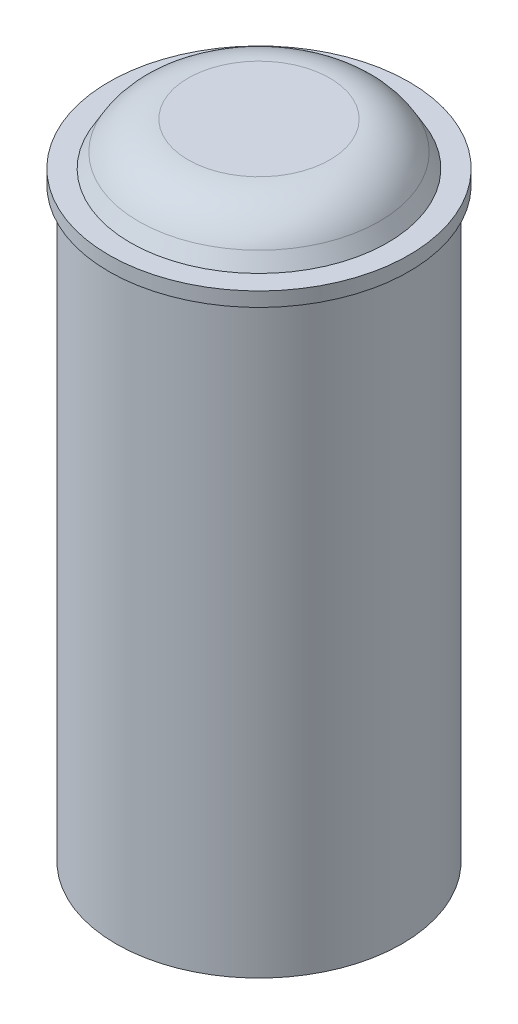
ISO-10303-21;
HEADER;
FILE_DESCRIPTION(('STEP AP214'),'2;1');
FILE_NAME('part.step','',(''),(''),'','','');
FILE_SCHEMA(('AUTOMOTIVE_DESIGN { 1 0 10303 214 1 1 1 1 }'));
ENDSEC;
DATA;
#1=APPLICATION_CONTEXT('core data for automotive mechanical design processes');
#2=APPLICATION_PROTOCOL_DEFINITION('international standard','automotive_design',2000,#1);
#3=PRODUCT_CONTEXT('',#1,'mechanical');
#4=PRODUCT('Part','Part','',(#3));
#5=PRODUCT_RELATED_PRODUCT_CATEGORY('part','',(#4));
#6=PRODUCT_DEFINITION_FORMATION('','',#4);
#7=PRODUCT_DEFINITION_CONTEXT('part definition',#1,'design');
#8=PRODUCT_DEFINITION('design','',#6,#7);
#9=PRODUCT_DEFINITION_SHAPE('','',#8);
#10=(LENGTH_UNIT() NAMED_UNIT(*) SI_UNIT(.MILLI.,.METRE.));
#11=(NAMED_UNIT(*) PLANE_ANGLE_UNIT() SI_UNIT($,.RADIAN.));
#12=(NAMED_UNIT(*) SI_UNIT($,.STERADIAN.) SOLID_ANGLE_UNIT());
#13=UNCERTAINTY_MEASURE_WITH_UNIT(LENGTH_MEASURE(1.E-05),#10,'distance_accuracy_value','');
#14=(GEOMETRIC_REPRESENTATION_CONTEXT(3) GLOBAL_UNCERTAINTY_ASSIGNED_CONTEXT((#13)) GLOBAL_UNIT_ASSIGNED_CONTEXT((#10,
#11,#12)) REPRESENTATION_CONTEXT('',''));
#15=CARTESIAN_POINT('',(0.,0.,0.));
#16=DIRECTION('',(0.,0.,1.));
#17=DIRECTION('',(1.,0.,0.));
#18=AXIS2_PLACEMENT_3D('',#15,#16,#17);
#19=CARTESIAN_POINT('',(0.,53.34,0.));
#20=DIRECTION('',(0.,1.,0.));
#21=DIRECTION('',(0.,0.,1.));
#22=AXIS2_PLACEMENT_3D('',#19,#20,#21);
#23=PLANE('',#22);
#24=CARTESIAN_POINT('',(0.,53.34,0.));
#25=DIRECTION('',(0.,1.,0.));
#26=DIRECTION('',(0.,0.,1.));
#27=AXIS2_PLACEMENT_3D('',#24,#25,#26);
#28=CIRCLE('',#27,13.335);
#29=CARTESIAN_POINT('',(0.,53.34,13.335));
#30=VERTEX_POINT('',#29);
#31=EDGE_CURVE('E170',#30,#30,#28,.T.);
#32=ORIENTED_EDGE('',*,*,#31,.T.);
#33=EDGE_LOOP('',(#32));
#34=FACE_BOUND('',#33,.T.);
#35=CARTESIAN_POINT('',(0.,53.34,0.));
#36=DIRECTION('',(0.,1.,0.));
#37=DIRECTION('',(0.,0.,1.));
#38=AXIS2_PLACEMENT_3D('',#35,#36,#37);
#39=CIRCLE('',#38,11.43);
#40=CARTESIAN_POINT('',(0.,53.34,11.43));
#41=VERTEX_POINT('',#40);
#42=EDGE_CURVE('E174',#41,#41,#39,.T.);
#43=ORIENTED_EDGE('',*,*,#42,.F.);
#44=EDGE_LOOP('',(#43));
#45=FACE_BOUND('',#44,.T.);
#46=ADVANCED_FACE('F89',(#34,#45),#23,.T.);
#47=CARTESIAN_POINT('',(0.,1.27,0.));
#48=DIRECTION('',(0.,-1.,0.));
#49=DIRECTION('',(0.,0.,-1.));
#50=AXIS2_PLACEMENT_3D('',#47,#48,#49);
#51=CYLINDRICAL_SURFACE('',#50,12.7);
#52=CARTESIAN_POINT('',(0.,0.,0.));
#53=DIRECTION('',(0.,1.,0.));
#54=DIRECTION('',(0.,0.,1.));
#55=AXIS2_PLACEMENT_3D('',#52,#53,#54);
#56=CIRCLE('',#55,12.7);
#57=CARTESIAN_POINT('',(0.,0.,12.7));
#58=VERTEX_POINT('',#57);
#59=EDGE_CURVE('E105',#58,#58,#56,.T.);
#60=ORIENTED_EDGE('',*,*,#59,.T.);
#61=EDGE_LOOP('',(#60));
#62=FACE_BOUND('',#61,.T.);
#63=CARTESIAN_POINT('',(0.,52.07,0.));
#64=DIRECTION('',(0.,1.,0.));
#65=DIRECTION('',(0.,0.,1.));
#66=AXIS2_PLACEMENT_3D('',#63,#64,#65);
#67=CIRCLE('',#66,12.7);
#68=CARTESIAN_POINT('',(0.,52.07,12.7));
#69=VERTEX_POINT('',#68);
#70=EDGE_CURVE('E110',#69,#69,#67,.T.);
#71=ORIENTED_EDGE('',*,*,#70,.F.);
#72=EDGE_LOOP('',(#71));
#73=FACE_BOUND('',#72,.T.);
#74=ADVANCED_FACE('F183',(#62,#73),#51,.T.);
#75=CARTESIAN_POINT('',(0.,0.,0.));
#76=DIRECTION('',(0.,1.,0.));
#77=DIRECTION('',(0.,0.,1.));
#78=AXIS2_PLACEMENT_3D('',#75,#76,#77);
#79=PLANE('',#78);
#80=ORIENTED_EDGE('',*,*,#59,.F.);
#81=EDGE_LOOP('',(#80));
#82=FACE_BOUND('',#81,.T.);
#83=ADVANCED_FACE('F189',(#82),#79,.F.);
#84=CARTESIAN_POINT('',(0.,52.07,0.));
#85=DIRECTION('',(0.,1.,0.));
#86=DIRECTION('',(0.,0.,1.));
#87=AXIS2_PLACEMENT_3D('',#84,#85,#86);
#88=PLANE('',#87);
#89=CARTESIAN_POINT('',(0.,52.07,0.));
#90=DIRECTION('',(0.,1.,0.));
#91=DIRECTION('',(0.,0.,1.));
#92=AXIS2_PLACEMENT_3D('',#89,#90,#91);
#93=CIRCLE('',#92,13.335);
#94=CARTESIAN_POINT('',(0.,52.07,13.335));
#95=VERTEX_POINT('',#94);
#96=EDGE_CURVE('E171',#95,#95,#93,.T.);
#97=ORIENTED_EDGE('',*,*,#96,.F.);
#98=EDGE_LOOP('',(#97));
#99=FACE_BOUND('',#98,.T.);
#100=ORIENTED_EDGE('',*,*,#70,.T.);
#101=EDGE_LOOP('',(#100));
#102=FACE_BOUND('',#101,.T.);
#103=ADVANCED_FACE('F194',(#99,#102),#88,.F.);
#104=CARTESIAN_POINT('',(0.,53.34,0.));
#105=DIRECTION('',(0.,-1.,0.));
#106=DIRECTION('',(0.,0.,-1.));
#107=AXIS2_PLACEMENT_3D('',#104,#105,#106);
#108=CYLINDRICAL_SURFACE('',#107,13.335);
#109=ORIENTED_EDGE('',*,*,#31,.F.);
#110=EDGE_LOOP('',(#109));
#111=FACE_BOUND('',#110,.T.);
#112=ORIENTED_EDGE('',*,*,#96,.T.);
#113=EDGE_LOOP('',(#112));
#114=FACE_BOUND('',#113,.T.);
#115=ADVANCED_FACE('F197',(#111,#114),#108,.T.);
#116=CARTESIAN_POINT('',(0.,53.34,0.));
#117=DIRECTION('',(0.,-1.,0.));
#118=DIRECTION('',(0.,0.,1.));
#119=AXIS2_PLACEMENT_3D('',#116,#117,#118);
#120=CONICAL_SURFACE('',#119,11.43,0.5235987755983);
#121=CARTESIAN_POINT('',(0.,54.61,0.));
#122=DIRECTION('',(0.,-1.,0.));
#123=DIRECTION('',(0.,0.,-1.));
#124=AXIS2_PLACEMENT_3D('',#121,#122,#123);
#125=CIRCLE('',#124,10.6967651581292);
#126=CARTESIAN_POINT('',(0.,54.61,-10.6967651581292));
#127=VERTEX_POINT('',#126);
#128=EDGE_CURVE('E11',#127,#127,#125,.T.);
#129=ORIENTED_EDGE('',*,*,#128,.T.);
#130=EDGE_LOOP('',(#129));
#131=FACE_BOUND('',#130,.T.);
#132=ORIENTED_EDGE('',*,*,#42,.T.);
#133=EDGE_LOOP('',(#132));
#134=FACE_BOUND('',#133,.T.);
#135=ADVANCED_FACE('F180',(#131,#134),#120,.T.);
#136=CARTESIAN_POINT('',(0.,57.15,0.));
#137=DIRECTION('',(0.,1.,0.));
#138=DIRECTION('',(0.,0.,1.));
#139=AXIS2_PLACEMENT_3D('',#136,#137,#138);
#140=PLANE('',#139);
#141=CARTESIAN_POINT('',(0.,57.15,0.));
#142=DIRECTION('',(0.,1.,0.));
#143=DIRECTION('',(0.,0.,1.));
#144=AXIS2_PLACEMENT_3D('',#141,#142,#143);
#145=CIRCLE('',#144,6.29735610690422);
#146=CARTESIAN_POINT('',(0.,57.15,6.29735610690422));
#147=VERTEX_POINT('',#146);
#148=EDGE_CURVE('E97',#147,#147,#145,.T.);
#149=ORIENTED_EDGE('',*,*,#148,.T.);
#150=EDGE_LOOP('',(#149));
#151=FACE_BOUND('',#150,.T.);
#152=ADVANCED_FACE('F274',(#151),#140,.T.);
#153=CARTESIAN_POINT('',(0.,52.07,0.));
#154=DIRECTION('',(0.,1.,0.));
#155=DIRECTION('',(0.,0.,1.));
#156=AXIS2_PLACEMENT_3D('',#153,#154,#155);
#157=TOROIDAL_SURFACE('',#156,6.29735610690422,5.08);
#158=ORIENTED_EDGE('',*,*,#128,.F.);
#159=EDGE_LOOP('',(#158));
#160=FACE_BOUND('',#159,.T.);
#161=ORIENTED_EDGE('',*,*,#148,.F.);
#162=EDGE_LOOP('',(#161));
#163=FACE_BOUND('',#162,.T.);
#164=ADVANCED_FACE('F91',(#160,#163),#157,.T.);
#165=CLOSED_SHELL('',(#46,#74,#83,#103,#115,#135,#152,#164));
#166=CARTESIAN_POINT('',(0.,52.07,0.));
#167=DIRECTION('',(0.,1.,0.));
#168=DIRECTION('',(0.,0.,1.));
#169=AXIS2_PLACEMENT_3D('',#166,#167,#168);
#170=CIRCLE('',#169,11.43);
#171=CARTESIAN_POINT('',(0.,52.07,11.43));
#172=VERTEX_POINT('',#171);
#173=EDGE_CURVE('E165',#172,#172,#170,.T.);
#174=ORIENTED_EDGE('',*,*,#173,.F.);
#175=EDGE_LOOP('',(#174));
#176=FACE_BOUND('',#175,.T.);
#177=CARTESIAN_POINT('',(-4.49012806053452,52.07,-4.49012806053463));
#178=DIRECTION('',(0.,1.,0.));
#179=DIRECTION('',(0.,0.,1.));
#180=AXIS2_PLACEMENT_3D('',#177,#178,#179);
#181=CIRCLE('',#180,1.27);
#182=CARTESIAN_POINT('',(-4.49012806053452,52.07,-3.22012806053463));
#183=VERTEX_POINT('',#182);
#184=EDGE_CURVE('E117',#183,#183,#181,.T.);
#185=ORIENTED_EDGE('',*,*,#184,.T.);
#186=EDGE_LOOP('',(#185));
#187=FACE_BOUND('',#186,.T.);
#188=CARTESIAN_POINT('',(0.,52.07,0.));
#189=DIRECTION('',(0.,1.,0.));
#190=DIRECTION('',(0.,0.,1.));
#191=AXIS2_PLACEMENT_3D('',#188,#189,#190);
#192=CIRCLE('',#191,2.54);
#193=CARTESIAN_POINT('',(0.,52.07,2.54));
#194=VERTEX_POINT('',#193);
#195=EDGE_CURVE('E129',#194,#194,#192,.T.);
#196=ORIENTED_EDGE('',*,*,#195,.T.);
#197=EDGE_LOOP('',(#196));
#198=FACE_BOUND('',#197,.T.);
#199=CARTESIAN_POINT('',(4.49012806053458,52.07,-4.49012806053457));
#200=DIRECTION('',(0.,1.,0.));
#201=DIRECTION('',(0.,0.,1.));
#202=AXIS2_PLACEMENT_3D('',#199,#200,#201);
#203=CIRCLE('',#202,1.27);
#204=CARTESIAN_POINT('',(4.49012806053458,52.07,-3.22012806053457));
#205=VERTEX_POINT('',#204);
#206=EDGE_CURVE('E141',#205,#205,#203,.T.);
#207=ORIENTED_EDGE('',*,*,#206,.T.);
#208=EDGE_LOOP('',(#207));
#209=FACE_BOUND('',#208,.T.);
#210=CARTESIAN_POINT('',(4.49012806053455,52.07,4.4901280605346));
#211=DIRECTION('',(0.,1.,0.));
#212=DIRECTION('',(0.,0.,1.));
#213=AXIS2_PLACEMENT_3D('',#210,#211,#212);
#214=CIRCLE('',#213,1.27);
#215=CARTESIAN_POINT('',(4.49012806053455,52.07,5.7601280605346));
#216=VERTEX_POINT('',#215);
#217=EDGE_CURVE('E153',#216,#216,#214,.T.);
#218=ORIENTED_EDGE('',*,*,#217,.T.);
#219=EDGE_LOOP('',(#218));
#220=FACE_BOUND('',#219,.T.);
#221=CARTESIAN_POINT('',(0.,52.07,6.35));
#222=DIRECTION('',(0.,1.,0.));
#223=DIRECTION('',(0.,0.,1.));
#224=AXIS2_PLACEMENT_3D('',#221,#222,#223);
#225=CIRCLE('',#224,1.27);
#226=CARTESIAN_POINT('',(0.,52.07,7.62));
#227=VERTEX_POINT('',#226);
#228=EDGE_CURVE('E159',#227,#227,#225,.T.);
#229=ORIENTED_EDGE('',*,*,#228,.T.);
#230=EDGE_LOOP('',(#229));
#231=FACE_BOUND('',#230,.T.);
#232=CARTESIAN_POINT('',(6.35,52.07,0.));
#233=DIRECTION('',(0.,1.,0.));
#234=DIRECTION('',(0.,0.,1.));
#235=AXIS2_PLACEMENT_3D('',#232,#233,#234);
#236=CIRCLE('',#235,1.27);
#237=CARTESIAN_POINT('',(6.35,52.07,1.27000000000002));
#238=VERTEX_POINT('',#237);
#239=EDGE_CURVE('E147',#238,#238,#236,.T.);
#240=ORIENTED_EDGE('',*,*,#239,.T.);
#241=EDGE_LOOP('',(#240));
#242=FACE_BOUND('',#241,.T.);
#243=CARTESIAN_POINT('',(0.,52.07,-6.35));
#244=DIRECTION('',(0.,1.,0.));
#245=DIRECTION('',(0.,0.,1.));
#246=AXIS2_PLACEMENT_3D('',#243,#244,#245);
#247=CIRCLE('',#246,1.27);
#248=CARTESIAN_POINT('',(0.,52.07,-5.08));
#249=VERTEX_POINT('',#248);
#250=EDGE_CURVE('E135',#249,#249,#247,.T.);
#251=ORIENTED_EDGE('',*,*,#250,.T.);
#252=EDGE_LOOP('',(#251));
#253=FACE_BOUND('',#252,.T.);
#254=CARTESIAN_POINT('',(-4.49012806053462,52.07,4.49012806053454));
#255=DIRECTION('',(0.,1.,0.));
#256=DIRECTION('',(0.,0.,1.));
#257=AXIS2_PLACEMENT_3D('',#254,#255,#256);
#258=CIRCLE('',#257,1.27);
#259=CARTESIAN_POINT('',(-4.49012806053462,52.07,5.76012806053454));
#260=VERTEX_POINT('',#259);
#261=EDGE_CURVE('E123',#260,#260,#258,.T.);
#262=ORIENTED_EDGE('',*,*,#261,.T.);
#263=EDGE_LOOP('',(#262));
#264=FACE_BOUND('',#263,.T.);
#265=CARTESIAN_POINT('',(-6.35,52.07,0.));
#266=DIRECTION('',(0.,1.,0.));
#267=DIRECTION('',(0.,0.,1.));
#268=AXIS2_PLACEMENT_3D('',#265,#266,#267);
#269=CIRCLE('',#268,1.27);
#270=CARTESIAN_POINT('',(-6.35,52.07,1.26999999999993));
#271=VERTEX_POINT('',#270);
#272=EDGE_CURVE('E113',#271,#271,#269,.T.);
#273=ORIENTED_EDGE('',*,*,#272,.T.);
#274=EDGE_LOOP('',(#273));
#275=FACE_BOUND('',#274,.T.);
#276=ADVANCED_FACE('F199',(#176,#187,#198,#209,#220,#231,#242,#253,#264,#275),#88,.F.);
#277=CARTESIAN_POINT('',(6.35,52.07,0.));
#278=DIRECTION('',(0.,-1.,0.));
#279=DIRECTION('',(0.,0.,-1.));
#280=AXIS2_PLACEMENT_3D('',#277,#278,#279);
#281=CYLINDRICAL_SURFACE('',#280,1.27);
#282=ORIENTED_EDGE('',*,*,#239,.F.);
#283=EDGE_LOOP('',(#282));
#284=FACE_BOUND('',#283,.T.);
#285=CARTESIAN_POINT('',(6.35,1.27,0.));
#286=DIRECTION('',(0.,1.,0.));
#287=DIRECTION('',(0.,0.,1.));
#288=AXIS2_PLACEMENT_3D('',#285,#286,#287);
#289=CIRCLE('',#288,1.27);
#290=CARTESIAN_POINT('',(6.35,1.27,1.27000000000002));
#291=VERTEX_POINT('',#290);
#292=EDGE_CURVE('E150',#291,#291,#289,.T.);
#293=ORIENTED_EDGE('',*,*,#292,.T.);
#294=EDGE_LOOP('',(#293));
#295=FACE_BOUND('',#294,.T.);
#296=ADVANCED_FACE('F214',(#284,#295),#281,.T.);
#297=CARTESIAN_POINT('',(0.,52.07,-6.35));
#298=DIRECTION('',(0.,-1.,0.));
#299=DIRECTION('',(0.,0.,-1.));
#300=AXIS2_PLACEMENT_3D('',#297,#298,#299);
#301=CYLINDRICAL_SURFACE('',#300,1.27);
#302=ORIENTED_EDGE('',*,*,#250,.F.);
#303=EDGE_LOOP('',(#302));
#304=FACE_BOUND('',#303,.T.);
#305=CARTESIAN_POINT('',(0.,1.27,-6.35));
#306=DIRECTION('',(0.,1.,0.));
#307=DIRECTION('',(0.,0.,1.));
#308=AXIS2_PLACEMENT_3D('',#305,#306,#307);
#309=CIRCLE('',#308,1.27);
#310=CARTESIAN_POINT('',(0.,1.27,-5.08));
#311=VERTEX_POINT('',#310);
#312=EDGE_CURVE('E138',#311,#311,#309,.T.);
#313=ORIENTED_EDGE('',*,*,#312,.T.);
#314=EDGE_LOOP('',(#313));
#315=FACE_BOUND('',#314,.T.);
#316=ADVANCED_FACE('F217',(#304,#315),#301,.T.);
#317=CARTESIAN_POINT('',(-4.49012806053462,52.07,4.49012806053454));
#318=DIRECTION('',(0.,-1.,0.));
#319=DIRECTION('',(0.,0.,-1.));
#320=AXIS2_PLACEMENT_3D('',#317,#318,#319);
#321=CYLINDRICAL_SURFACE('',#320,1.27);
#322=ORIENTED_EDGE('',*,*,#261,.F.);
#323=EDGE_LOOP('',(#322));
#324=FACE_BOUND('',#323,.T.);
#325=CARTESIAN_POINT('',(-4.49012806053462,1.27,4.49012806053454));
#326=DIRECTION('',(0.,1.,0.));
#327=DIRECTION('',(0.,0.,1.));
#328=AXIS2_PLACEMENT_3D('',#325,#326,#327);
#329=CIRCLE('',#328,1.27);
#330=CARTESIAN_POINT('',(-4.49012806053462,1.27,5.76012806053454));
#331=VERTEX_POINT('',#330);
#332=EDGE_CURVE('E126',#331,#331,#329,.T.);
#333=ORIENTED_EDGE('',*,*,#332,.T.);
#334=EDGE_LOOP('',(#333));
#335=FACE_BOUND('',#334,.T.);
#336=ADVANCED_FACE('F225',(#324,#335),#321,.T.);
#337=CARTESIAN_POINT('',(-6.35,52.07,0.));
#338=DIRECTION('',(0.,-1.,0.));
#339=DIRECTION('',(0.,0.,-1.));
#340=AXIS2_PLACEMENT_3D('',#337,#338,#339);
#341=CYLINDRICAL_SURFACE('',#340,1.27);
#342=ORIENTED_EDGE('',*,*,#272,.F.);
#343=EDGE_LOOP('',(#342));
#344=FACE_BOUND('',#343,.T.);
#345=CARTESIAN_POINT('',(-6.35,1.27,0.));
#346=DIRECTION('',(0.,1.,0.));
#347=DIRECTION('',(0.,0.,1.));
#348=AXIS2_PLACEMENT_3D('',#345,#346,#347);
#349=CIRCLE('',#348,1.27);
#350=CARTESIAN_POINT('',(-6.35,1.27,1.26999999999993));
#351=VERTEX_POINT('',#350);
#352=EDGE_CURVE('E114',#351,#351,#349,.T.);
#353=ORIENTED_EDGE('',*,*,#352,.T.);
#354=EDGE_LOOP('',(#353));
#355=FACE_BOUND('',#354,.T.);
#356=ADVANCED_FACE('F233',(#344,#355),#341,.T.);
#357=CARTESIAN_POINT('',(0.,52.07,0.));
#358=DIRECTION('',(0.,-1.,0.));
#359=DIRECTION('',(0.,0.,-1.));
#360=AXIS2_PLACEMENT_3D('',#357,#358,#359);
#361=CYLINDRICAL_SURFACE('',#360,11.43);
#362=ORIENTED_EDGE('',*,*,#173,.T.);
#363=EDGE_LOOP('',(#362));
#364=FACE_BOUND('',#363,.T.);
#365=CARTESIAN_POINT('',(0.,1.27,0.));
#366=DIRECTION('',(0.,1.,0.));
#367=DIRECTION('',(0.,0.,1.));
#368=AXIS2_PLACEMENT_3D('',#365,#366,#367);
#369=CIRCLE('',#368,11.43);
#370=CARTESIAN_POINT('',(0.,1.27,11.43));
#371=VERTEX_POINT('',#370);
#372=EDGE_CURVE('E101',#371,#371,#369,.F.);
#373=ORIENTED_EDGE('',*,*,#372,.T.);
#374=EDGE_LOOP('',(#373));
#375=FACE_BOUND('',#374,.T.);
#376=ADVANCED_FACE('F237',(#364,#375),#361,.F.);
#377=CARTESIAN_POINT('',(-4.49012806053452,52.07,-4.49012806053463));
#378=DIRECTION('',(0.,-1.,0.));
#379=DIRECTION('',(0.,0.,-1.));
#380=AXIS2_PLACEMENT_3D('',#377,#378,#379);
#381=CYLINDRICAL_SURFACE('',#380,1.27);
#382=ORIENTED_EDGE('',*,*,#184,.F.);
#383=EDGE_LOOP('',(#382));
#384=FACE_BOUND('',#383,.T.);
#385=CARTESIAN_POINT('',(-4.49012806053452,1.27,-4.49012806053463));
#386=DIRECTION('',(0.,1.,0.));
#387=DIRECTION('',(0.,0.,1.));
#388=AXIS2_PLACEMENT_3D('',#385,#386,#387);
#389=CIRCLE('',#388,1.27);
#390=CARTESIAN_POINT('',(-4.49012806053452,1.27,-3.22012806053463));
#391=VERTEX_POINT('',#390);
#392=EDGE_CURVE('E120',#391,#391,#389,.T.);
#393=ORIENTED_EDGE('',*,*,#392,.T.);
#394=EDGE_LOOP('',(#393));
#395=FACE_BOUND('',#394,.T.);
#396=ADVANCED_FACE('F229',(#384,#395),#381,.T.);
#397=CARTESIAN_POINT('',(0.,52.07,0.));
#398=DIRECTION('',(0.,-1.,0.));
#399=DIRECTION('',(0.,0.,-1.));
#400=AXIS2_PLACEMENT_3D('',#397,#398,#399);
#401=CYLINDRICAL_SURFACE('',#400,2.54);
#402=ORIENTED_EDGE('',*,*,#195,.F.);
#403=EDGE_LOOP('',(#402));
#404=FACE_BOUND('',#403,.T.);
#405=CARTESIAN_POINT('',(0.,1.27,0.));
#406=DIRECTION('',(0.,1.,0.));
#407=DIRECTION('',(0.,0.,1.));
#408=AXIS2_PLACEMENT_3D('',#405,#406,#407);
#409=CIRCLE('',#408,2.54);
#410=CARTESIAN_POINT('',(0.,1.27,2.54));
#411=VERTEX_POINT('',#410);
#412=EDGE_CURVE('E132',#411,#411,#409,.T.);
#413=ORIENTED_EDGE('',*,*,#412,.T.);
#414=EDGE_LOOP('',(#413));
#415=FACE_BOUND('',#414,.T.);
#416=ADVANCED_FACE('F221',(#404,#415),#401,.T.);
#417=CARTESIAN_POINT('',(4.49012806053458,52.07,-4.49012806053457));
#418=DIRECTION('',(0.,-1.,0.));
#419=DIRECTION('',(0.,0.,-1.));
#420=AXIS2_PLACEMENT_3D('',#417,#418,#419);
#421=CYLINDRICAL_SURFACE('',#420,1.27);
#422=ORIENTED_EDGE('',*,*,#206,.F.);
#423=EDGE_LOOP('',(#422));
#424=FACE_BOUND('',#423,.T.);
#425=CARTESIAN_POINT('',(4.49012806053458,1.27,-4.49012806053457));
#426=DIRECTION('',(0.,1.,0.));
#427=DIRECTION('',(0.,0.,1.));
#428=AXIS2_PLACEMENT_3D('',#425,#426,#427);
#429=CIRCLE('',#428,1.27);
#430=CARTESIAN_POINT('',(4.49012806053458,1.27,-3.22012806053457));
#431=VERTEX_POINT('',#430);
#432=EDGE_CURVE('E144',#431,#431,#429,.T.);
#433=ORIENTED_EDGE('',*,*,#432,.T.);
#434=EDGE_LOOP('',(#433));
#435=FACE_BOUND('',#434,.T.);
#436=ADVANCED_FACE('F212',(#424,#435),#421,.T.);
#437=CARTESIAN_POINT('',(4.49012806053455,52.07,4.4901280605346));
#438=DIRECTION('',(0.,-1.,0.));
#439=DIRECTION('',(0.,0.,-1.));
#440=AXIS2_PLACEMENT_3D('',#437,#438,#439);
#441=CYLINDRICAL_SURFACE('',#440,1.27);
#442=ORIENTED_EDGE('',*,*,#217,.F.);
#443=EDGE_LOOP('',(#442));
#444=FACE_BOUND('',#443,.T.);
#445=CARTESIAN_POINT('',(4.49012806053455,1.27,4.4901280605346));
#446=DIRECTION('',(0.,1.,0.));
#447=DIRECTION('',(0.,0.,1.));
#448=AXIS2_PLACEMENT_3D('',#445,#446,#447);
#449=CIRCLE('',#448,1.27);
#450=CARTESIAN_POINT('',(4.49012806053455,1.27,5.7601280605346));
#451=VERTEX_POINT('',#450);
#452=EDGE_CURVE('E156',#451,#451,#449,.T.);
#453=ORIENTED_EDGE('',*,*,#452,.T.);
#454=EDGE_LOOP('',(#453));
#455=FACE_BOUND('',#454,.T.);
#456=ADVANCED_FACE('F209',(#444,#455),#441,.T.);
#457=CARTESIAN_POINT('',(0.,1.27,0.));
#458=DIRECTION('',(0.,1.,0.));
#459=DIRECTION('',(0.,0.,1.));
#460=AXIS2_PLACEMENT_3D('',#457,#458,#459);
#461=PLANE('',#460);
#462=ORIENTED_EDGE('',*,*,#452,.F.);
#463=EDGE_LOOP('',(#462));
#464=FACE_BOUND('',#463,.T.);
#465=ORIENTED_EDGE('',*,*,#432,.F.);
#466=EDGE_LOOP('',(#465));
#467=FACE_BOUND('',#466,.T.);
#468=ORIENTED_EDGE('',*,*,#412,.F.);
#469=EDGE_LOOP('',(#468));
#470=FACE_BOUND('',#469,.T.);
#471=ORIENTED_EDGE('',*,*,#392,.F.);
#472=EDGE_LOOP('',(#471));
#473=FACE_BOUND('',#472,.T.);
#474=ORIENTED_EDGE('',*,*,#372,.F.);
#475=EDGE_LOOP('',(#474));
#476=FACE_BOUND('',#475,.T.);
#477=ORIENTED_EDGE('',*,*,#352,.F.);
#478=EDGE_LOOP('',(#477));
#479=FACE_BOUND('',#478,.T.);
#480=ORIENTED_EDGE('',*,*,#332,.F.);
#481=EDGE_LOOP('',(#480));
#482=FACE_BOUND('',#481,.T.);
#483=ORIENTED_EDGE('',*,*,#312,.F.);
#484=EDGE_LOOP('',(#483));
#485=FACE_BOUND('',#484,.T.);
#486=ORIENTED_EDGE('',*,*,#292,.F.);
#487=EDGE_LOOP('',(#486));
#488=FACE_BOUND('',#487,.T.);
#489=CARTESIAN_POINT('',(0.,1.27,6.35));
#490=DIRECTION('',(0.,1.,0.));
#491=DIRECTION('',(0.,0.,1.));
#492=AXIS2_PLACEMENT_3D('',#489,#490,#491);
#493=CIRCLE('',#492,1.27);
#494=CARTESIAN_POINT('',(0.,1.27,7.62));
#495=VERTEX_POINT('',#494);
#496=EDGE_CURVE('E162',#495,#495,#493,.T.);
#497=ORIENTED_EDGE('',*,*,#496,.F.);
#498=EDGE_LOOP('',(#497));
#499=FACE_BOUND('',#498,.T.);
#500=ADVANCED_FACE('F206',(#464,#467,#470,#473,#476,#479,#482,#485,#488,#499),#461,.T.);
#501=CARTESIAN_POINT('',(0.,52.07,6.35));
#502=DIRECTION('',(0.,-1.,0.));
#503=DIRECTION('',(0.,0.,-1.));
#504=AXIS2_PLACEMENT_3D('',#501,#502,#503);
#505=CYLINDRICAL_SURFACE('',#504,1.27);
#506=ORIENTED_EDGE('',*,*,#228,.F.);
#507=EDGE_LOOP('',(#506));
#508=FACE_BOUND('',#507,.T.);
#509=ORIENTED_EDGE('',*,*,#496,.T.);
#510=EDGE_LOOP('',(#509));
#511=FACE_BOUND('',#510,.T.);
#512=ADVANCED_FACE('F203',(#508,#511),#505,.T.);
#513=CLOSED_SHELL('',(#276,#296,#316,#336,#356,#376,#396,#416,#436,#456,#500,#512));
#514=ORIENTED_CLOSED_SHELL('',*,#513,.T.);
#515=BREP_WITH_VOIDS('B2',#165,(#514));
#516=ADVANCED_BREP_SHAPE_REPRESENTATION('',(#18,#515),#14);
#517=SHAPE_DEFINITION_REPRESENTATION(#9,#516);
ENDSEC;
END-ISO-10303-21;
